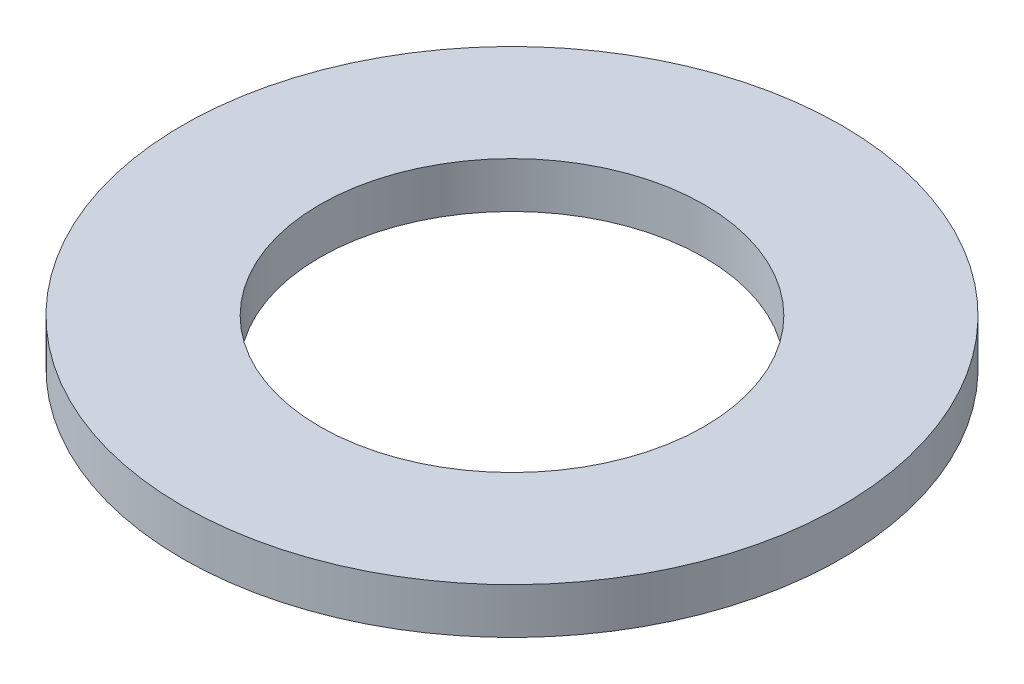
ISO-10303-21;
HEADER;
FILE_DESCRIPTION(('STEP AP214'),'2;1');
FILE_NAME('part.step','',(''),(''),'','','');
FILE_SCHEMA(('AUTOMOTIVE_DESIGN { 1 0 10303 214 1 1 1 1 }'));
ENDSEC;
DATA;
#1=APPLICATION_CONTEXT('core data for automotive mechanical design processes');
#2=APPLICATION_PROTOCOL_DEFINITION('international standard','automotive_design',2000,#1);
#3=PRODUCT_CONTEXT('',#1,'mechanical');
#4=PRODUCT('Part','Part','',(#3));
#5=PRODUCT_RELATED_PRODUCT_CATEGORY('part','',(#4));
#6=PRODUCT_DEFINITION_FORMATION('','',#4);
#7=PRODUCT_DEFINITION_CONTEXT('part definition',#1,'design');
#8=PRODUCT_DEFINITION('design','',#6,#7);
#9=PRODUCT_DEFINITION_SHAPE('','',#8);
#10=(LENGTH_UNIT() NAMED_UNIT(*) SI_UNIT(.MILLI.,.METRE.));
#11=(NAMED_UNIT(*) PLANE_ANGLE_UNIT() SI_UNIT($,.RADIAN.));
#12=(NAMED_UNIT(*) SI_UNIT($,.STERADIAN.) SOLID_ANGLE_UNIT());
#13=UNCERTAINTY_MEASURE_WITH_UNIT(LENGTH_MEASURE(1.E-05),#10,'distance_accuracy_value','');
#14=(GEOMETRIC_REPRESENTATION_CONTEXT(3) GLOBAL_UNCERTAINTY_ASSIGNED_CONTEXT((#13)) GLOBAL_UNIT_ASSIGNED_CONTEXT((#10,
#11,#12)) REPRESENTATION_CONTEXT('',''));
#15=CARTESIAN_POINT('',(0.,0.,0.));
#16=DIRECTION('',(0.,0.,1.));
#17=DIRECTION('',(1.,0.,0.));
#18=AXIS2_PLACEMENT_3D('',#15,#16,#17);
#19=CARTESIAN_POINT('',(0.,0.,0.));
#20=DIRECTION('',(0.,-1.,0.));
#21=DIRECTION('',(0.,0.,-1.));
#22=AXIS2_PLACEMENT_3D('',#19,#20,#21);
#23=CYLINDRICAL_SURFACE('',#22,4.2);
#24=CARTESIAN_POINT('',(0.,1.,0.));
#25=DIRECTION('',(0.,-1.,0.));
#26=DIRECTION('',(0.,0.,-1.));
#27=AXIS2_PLACEMENT_3D('',#24,#25,#26);
#28=CIRCLE('',#27,4.2);
#29=CARTESIAN_POINT('',(0.,1.,-4.2));
#30=VERTEX_POINT('',#29);
#31=EDGE_CURVE('E10',#30,#30,#28,.T.);
#32=ORIENTED_EDGE('',*,*,#31,.F.);
#33=EDGE_LOOP('',(#32));
#34=FACE_BOUND('',#33,.T.);
#35=CARTESIAN_POINT('',(0.,0.,0.));
#36=DIRECTION('',(0.,-1.,0.));
#37=DIRECTION('',(0.,0.,-1.));
#38=AXIS2_PLACEMENT_3D('',#35,#36,#37);
#39=CIRCLE('',#38,4.2);
#40=CARTESIAN_POINT('',(0.,0.,-4.2));
#41=VERTEX_POINT('',#40);
#42=EDGE_CURVE('E54',#41,#41,#39,.T.);
#43=ORIENTED_EDGE('',*,*,#42,.T.);
#44=EDGE_LOOP('',(#43));
#45=FACE_BOUND('',#44,.T.);
#46=ADVANCED_FACE('F37',(#34,#45),#23,.F.);
#47=CARTESIAN_POINT('',(-4.2,1.,0.));
#48=DIRECTION('',(0.,-1.,0.));
#49=DIRECTION('',(0.,0.,-1.));
#50=AXIS2_PLACEMENT_3D('',#47,#48,#49);
#51=PLANE('',#50);
#52=CARTESIAN_POINT('',(0.,1.,0.));
#53=DIRECTION('',(0.,-1.,0.));
#54=DIRECTION('',(0.,0.,-1.));
#55=AXIS2_PLACEMENT_3D('',#52,#53,#54);
#56=CIRCLE('',#55,7.2);
#57=CARTESIAN_POINT('',(0.,1.,-7.2));
#58=VERTEX_POINT('',#57);
#59=EDGE_CURVE('E44',#58,#58,#56,.T.);
#60=ORIENTED_EDGE('',*,*,#59,.F.);
#61=EDGE_LOOP('',(#60));
#62=FACE_BOUND('',#61,.T.);
#63=ORIENTED_EDGE('',*,*,#31,.T.);
#64=EDGE_LOOP('',(#63));
#65=FACE_BOUND('',#64,.T.);
#66=ADVANCED_FACE('F70',(#62,#65),#51,.F.);
#67=CARTESIAN_POINT('',(0.,0.,0.));
#68=DIRECTION('',(0.,-1.,0.));
#69=DIRECTION('',(0.,0.,-1.));
#70=AXIS2_PLACEMENT_3D('',#67,#68,#69);
#71=CYLINDRICAL_SURFACE('',#70,7.2);
#72=CARTESIAN_POINT('',(0.,0.,0.));
#73=DIRECTION('',(0.,-1.,0.));
#74=DIRECTION('',(0.,0.,-1.));
#75=AXIS2_PLACEMENT_3D('',#72,#73,#74);
#76=CIRCLE('',#75,7.2);
#77=CARTESIAN_POINT('',(0.,0.,-7.2));
#78=VERTEX_POINT('',#77);
#79=EDGE_CURVE('E49',#78,#78,#76,.T.);
#80=ORIENTED_EDGE('',*,*,#79,.F.);
#81=EDGE_LOOP('',(#80));
#82=FACE_BOUND('',#81,.T.);
#83=ORIENTED_EDGE('',*,*,#59,.T.);
#84=EDGE_LOOP('',(#83));
#85=FACE_BOUND('',#84,.T.);
#86=ADVANCED_FACE('F65',(#82,#85),#71,.T.);
#87=CARTESIAN_POINT('',(-4.2,0.,0.));
#88=DIRECTION('',(0.,1.,0.));
#89=DIRECTION('',(0.,0.,1.));
#90=AXIS2_PLACEMENT_3D('',#87,#88,#89);
#91=PLANE('',#90);
#92=ORIENTED_EDGE('',*,*,#42,.F.);
#93=EDGE_LOOP('',(#92));
#94=FACE_BOUND('',#93,.T.);
#95=ORIENTED_EDGE('',*,*,#79,.T.);
#96=EDGE_LOOP('',(#95));
#97=FACE_BOUND('',#96,.T.);
#98=ADVANCED_FACE('F62',(#94,#97),#91,.F.);
#99=CLOSED_SHELL('',(#46,#66,#86,#98));
#100=MANIFOLD_SOLID_BREP('B2',#99);
#101=ADVANCED_BREP_SHAPE_REPRESENTATION('',(#18,#100),#14);
#102=SHAPE_DEFINITION_REPRESENTATION(#9,#101);
ENDSEC;
END-ISO-10303-21;
